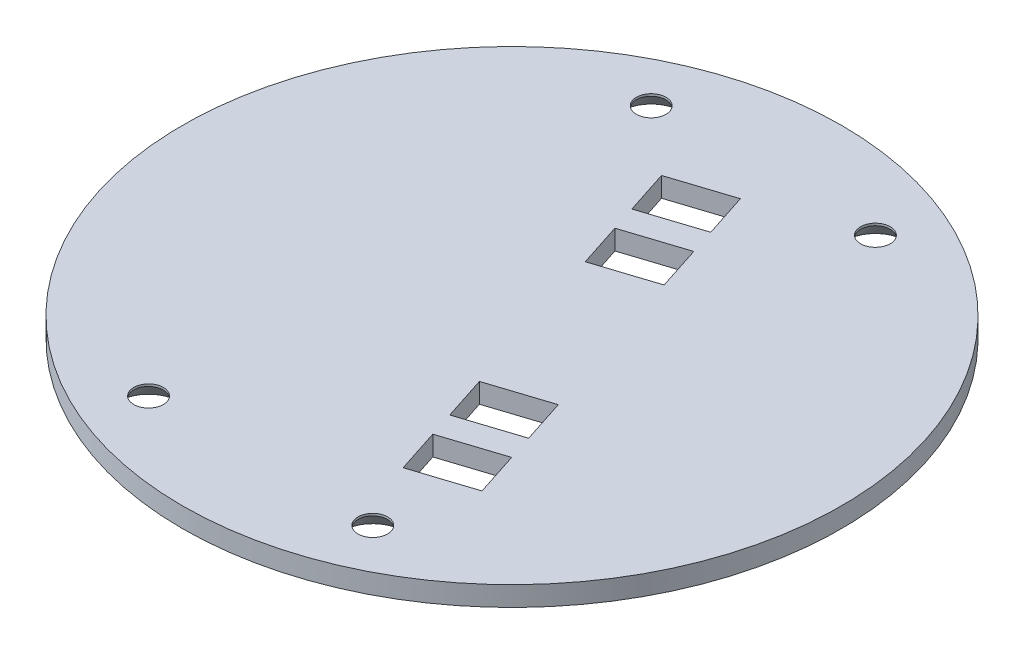
ISO-10303-21;
HEADER;
FILE_DESCRIPTION(('STEP AP214'),'2;1');
FILE_NAME('part.step','',(''),(''),'','','');
FILE_SCHEMA(('AUTOMOTIVE_DESIGN { 1 0 10303 214 1 1 1 1 }'));
ENDSEC;
DATA;
#1=APPLICATION_CONTEXT('core data for automotive mechanical design processes');
#2=APPLICATION_PROTOCOL_DEFINITION('international standard','automotive_design',2000,#1);
#3=PRODUCT_CONTEXT('',#1,'mechanical');
#4=PRODUCT('Part','Part','',(#3));
#5=PRODUCT_RELATED_PRODUCT_CATEGORY('part','',(#4));
#6=PRODUCT_DEFINITION_FORMATION('','',#4);
#7=PRODUCT_DEFINITION_CONTEXT('part definition',#1,'design');
#8=PRODUCT_DEFINITION('design','',#6,#7);
#9=PRODUCT_DEFINITION_SHAPE('','',#8);
#10=(LENGTH_UNIT() NAMED_UNIT(*) SI_UNIT(.MILLI.,.METRE.));
#11=(NAMED_UNIT(*) PLANE_ANGLE_UNIT() SI_UNIT($,.RADIAN.));
#12=(NAMED_UNIT(*) SI_UNIT($,.STERADIAN.) SOLID_ANGLE_UNIT());
#13=UNCERTAINTY_MEASURE_WITH_UNIT(LENGTH_MEASURE(1.E-05),#10,'distance_accuracy_value','');
#14=(GEOMETRIC_REPRESENTATION_CONTEXT(3) GLOBAL_UNCERTAINTY_ASSIGNED_CONTEXT((#13)) GLOBAL_UNIT_ASSIGNED_CONTEXT((#10,
#11,#12)) REPRESENTATION_CONTEXT('',''));
#15=CARTESIAN_POINT('',(0.,0.,0.));
#16=DIRECTION('',(0.,0.,1.));
#17=DIRECTION('',(1.,0.,0.));
#18=AXIS2_PLACEMENT_3D('',#15,#16,#17);
#19=CARTESIAN_POINT('',(0.,1.5,0.));
#20=DIRECTION('',(0.,1.,0.));
#21=DIRECTION('',(0.,0.,1.));
#22=AXIS2_PLACEMENT_3D('',#19,#20,#21);
#23=PLANE('',#22);
#24=CARTESIAN_POINT('',(17.0092592584861,1.5,38.1280421668568));
#25=DIRECTION('',(0.,-1.,0.));
#26=DIRECTION('',(0.,0.,-1.));
#27=AXIS2_PLACEMENT_3D('',#24,#25,#26);
#28=CIRCLE('',#27,2.2479);
#29=CARTESIAN_POINT('',(17.0092592584861,1.5,35.8801421668568));
#30=VERTEX_POINT('',#29);
#31=EDGE_CURVE('E366',#30,#30,#28,.T.);
#32=ORIENTED_EDGE('',*,*,#31,.T.);
#33=EDGE_LOOP('',(#32));
#34=FACE_BOUND('',#33,.T.);
#35=CARTESIAN_POINT('',(-17.0092592584861,1.5,38.1280421668568));
#36=DIRECTION('',(0.,-1.,0.));
#37=DIRECTION('',(0.,0.,-1.));
#38=AXIS2_PLACEMENT_3D('',#35,#36,#37);
#39=CIRCLE('',#38,2.2479);
#40=CARTESIAN_POINT('',(-17.0092592584861,1.5,35.8801421668568));
#41=VERTEX_POINT('',#40);
#42=EDGE_CURVE('E370',#41,#41,#39,.T.);
#43=ORIENTED_EDGE('',*,*,#42,.T.);
#44=EDGE_LOOP('',(#43));
#45=FACE_BOUND('',#44,.T.);
#46=CARTESIAN_POINT('',(-17.009259258486,1.5,-38.1280421668568));
#47=DIRECTION('',(0.,-1.,0.));
#48=DIRECTION('',(0.,0.,-1.));
#49=AXIS2_PLACEMENT_3D('',#46,#47,#48);
#50=CIRCLE('',#49,2.2479);
#51=CARTESIAN_POINT('',(-17.009259258486,1.5,-40.3759421668567));
#52=VERTEX_POINT('',#51);
#53=EDGE_CURVE('E374',#52,#52,#50,.T.);
#54=ORIENTED_EDGE('',*,*,#53,.T.);
#55=EDGE_LOOP('',(#54));
#56=FACE_BOUND('',#55,.T.);
#57=CARTESIAN_POINT('',(17.009259258486,1.5,-38.1280421668568));
#58=DIRECTION('',(0.,-1.,0.));
#59=DIRECTION('',(0.,0.,-1.));
#60=AXIS2_PLACEMENT_3D('',#57,#58,#59);
#61=CIRCLE('',#60,2.2479);
#62=CARTESIAN_POINT('',(17.009259258486,1.5,-40.3759421668567));
#63=VERTEX_POINT('',#62);
#64=EDGE_CURVE('E378',#63,#63,#61,.T.);
#65=ORIENTED_EDGE('',*,*,#64,.T.);
#66=EDGE_LOOP('',(#65));
#67=FACE_BOUND('',#66,.T.);
#68=DIRECTION('',(0.308303520094528,0.,0.951288042339082));
#69=VECTOR('',#68,1.);
#70=CARTESIAN_POINT('',(-7.06797710635094,1.5,-29.7553595949385));
#71=LINE('',#70,#69);
#72=CARTESIAN_POINT('',(-7.06797710635094,1.5,-29.7553595949385));
#73=VERTEX_POINT('',#72);
#74=CARTESIAN_POINT('',(-4.90985246568924,1.5,-23.0963432985649));
#75=VERTEX_POINT('',#74);
#76=EDGE_CURVE('E55',#73,#75,#71,.T.);
#77=ORIENTED_EDGE('',*,*,#76,.F.);
#78=DIRECTION('',(-0.951288042339082,0.,0.308303520094528));
#79=VECTOR('',#78,1.);
#80=CARTESIAN_POINT('',(1.96925929587035,1.5,-32.6842430358365));
#81=LINE('',#80,#79);
#82=CARTESIAN_POINT('',(1.96925929587035,1.5,-32.6842430358365));
#83=VERTEX_POINT('',#82);
#84=EDGE_CURVE('E172',#83,#73,#81,.T.);
#85=ORIENTED_EDGE('',*,*,#84,.F.);
#86=DIRECTION('',(-0.308303520094528,0.,-0.951288042339082));
#87=VECTOR('',#86,1.);
#88=CARTESIAN_POINT('',(4.12738393653204,1.5,-26.025226739463));
#89=LINE('',#88,#87);
#90=CARTESIAN_POINT('',(4.12738393653204,1.5,-26.025226739463));
#91=VERTEX_POINT('',#90);
#92=EDGE_CURVE('E178',#91,#83,#89,.T.);
#93=ORIENTED_EDGE('',*,*,#92,.F.);
#94=DIRECTION('',(0.951288042339082,0.,-0.308303520094528));
#95=VECTOR('',#94,1.);
#96=CARTESIAN_POINT('',(-4.90985246568924,1.5,-23.0963432985649));
#97=LINE('',#96,#95);
#98=EDGE_CURVE('E190',#75,#91,#97,.T.);
#99=ORIENTED_EDGE('',*,*,#98,.F.);
#100=EDGE_LOOP('',(#77,#85,#93,#99));
#101=FACE_BOUND('',#100,.T.);
#102=DIRECTION('',(-0.308303520094528,0.,-0.951288042339082));
#103=VECTOR('',#102,1.);
#104=CARTESIAN_POINT('',(5.36059801691015,1.5,-22.2200745701066));
#105=LINE('',#104,#103);
#106=CARTESIAN_POINT('',(7.51872265757185,1.5,-15.5610582737331));
#107=VERTEX_POINT('',#106);
#108=CARTESIAN_POINT('',(5.36059801691015,1.5,-22.2200745701066));
#109=VERTEX_POINT('',#108);
#110=EDGE_CURVE('E200',#107,#109,#105,.T.);
#111=ORIENTED_EDGE('',*,*,#110,.F.);
#112=DIRECTION('',(0.951288042339082,0.,-0.308303520094528));
#113=VECTOR('',#112,1.);
#114=CARTESIAN_POINT('',(7.51872265757185,1.5,-15.5610582737331));
#115=LINE('',#114,#113);
#116=CARTESIAN_POINT('',(-1.51851374464943,1.5,-12.632174832835));
#117=VERTEX_POINT('',#116);
#118=EDGE_CURVE('E211',#117,#107,#115,.T.);
#119=ORIENTED_EDGE('',*,*,#118,.F.);
#120=DIRECTION('',(0.308303520094528,0.,0.951288042339082));
#121=VECTOR('',#120,1.);
#122=CARTESIAN_POINT('',(-1.51851374464943,1.5,-12.632174832835));
#123=LINE('',#122,#121);
#124=CARTESIAN_POINT('',(-3.67663838531113,1.5,-19.2911911292086));
#125=VERTEX_POINT('',#124);
#126=EDGE_CURVE('E230',#125,#117,#123,.T.);
#127=ORIENTED_EDGE('',*,*,#126,.F.);
#128=DIRECTION('',(-0.951288042339082,0.,0.308303520094528));
#129=VECTOR('',#128,1.);
#130=CARTESIAN_POINT('',(-3.67663838531113,1.5,-19.2911911292086));
#131=LINE('',#130,#129);
#132=EDGE_CURVE('E226',#109,#125,#131,.T.);
#133=ORIENTED_EDGE('',*,*,#132,.F.);
#134=EDGE_LOOP('',(#111,#119,#127,#133));
#135=FACE_BOUND('',#134,.T.);
#136=DIRECTION('',(0.308303520094527,0.,0.951288042339082));
#137=VECTOR('',#136,1.);
#138=CARTESIAN_POINT('',(11.7292885138124,1.5,28.2446723464753));
#139=LINE('',#138,#137);
#140=CARTESIAN_POINT('',(9.57116387315074,1.5,21.5856560501018));
#141=VERTEX_POINT('',#140);
#142=CARTESIAN_POINT('',(11.7292885138124,1.5,28.2446723464753));
#143=VERTEX_POINT('',#142);
#144=EDGE_CURVE('E240',#141,#143,#139,.T.);
#145=ORIENTED_EDGE('',*,*,#144,.F.);
#146=DIRECTION('',(-0.951288042339082,0.,0.308303520094527));
#147=VECTOR('',#146,1.);
#148=CARTESIAN_POINT('',(9.57116387315074,1.5,21.5856560501018));
#149=LINE('',#148,#147);
#150=CARTESIAN_POINT('',(18.608400275372,1.5,18.6567726092037));
#151=VERTEX_POINT('',#150);
#152=EDGE_CURVE('E255',#151,#141,#149,.T.);
#153=ORIENTED_EDGE('',*,*,#152,.F.);
#154=DIRECTION('',(-0.308303520094528,0.,-0.951288042339082));
#155=VECTOR('',#154,1.);
#156=CARTESIAN_POINT('',(18.608400275372,1.5,18.6567726092037));
#157=LINE('',#156,#155);
#158=CARTESIAN_POINT('',(20.7665249160337,1.5,25.3157889055773));
#159=VERTEX_POINT('',#158);
#160=EDGE_CURVE('E274',#159,#151,#157,.T.);
#161=ORIENTED_EDGE('',*,*,#160,.F.);
#162=DIRECTION('',(0.951288042339082,0.,-0.308303520094527));
#163=VECTOR('',#162,1.);
#164=CARTESIAN_POINT('',(20.7665249160337,1.5,25.3157889055773));
#165=LINE('',#164,#163);
#166=EDGE_CURVE('E270',#143,#159,#165,.T.);
#167=ORIENTED_EDGE('',*,*,#166,.F.);
#168=EDGE_LOOP('',(#145,#153,#161,#167));
#169=FACE_BOUND('',#168,.T.);
#170=DIRECTION('',(0.308303520094528,0.,0.951288042339082));
#171=VECTOR('',#170,1.);
#172=CARTESIAN_POINT('',(6.17982515211094,1.5,11.1214875843719));
#173=LINE('',#172,#171);
#174=CARTESIAN_POINT('',(6.17982515211094,1.5,11.1214875843719));
#175=VERTEX_POINT('',#174);
#176=CARTESIAN_POINT('',(8.33794979277263,1.5,17.7805038807454));
#177=VERTEX_POINT('',#176);
#178=EDGE_CURVE('E284',#175,#177,#173,.T.);
#179=ORIENTED_EDGE('',*,*,#178,.F.);
#180=DIRECTION('',(-0.951288042339082,0.,0.308303520094528));
#181=VECTOR('',#180,1.);
#182=CARTESIAN_POINT('',(15.2170615543322,1.5,8.19260414347383));
#183=LINE('',#182,#181);
#184=CARTESIAN_POINT('',(15.2170615543322,1.5,8.19260414347383));
#185=VERTEX_POINT('',#184);
#186=EDGE_CURVE('E299',#185,#175,#183,.T.);
#187=ORIENTED_EDGE('',*,*,#186,.F.);
#188=DIRECTION('',(-0.308303520094528,0.,-0.951288042339082));
#189=VECTOR('',#188,1.);
#190=CARTESIAN_POINT('',(17.3751861949939,1.5,14.8516204398474));
#191=LINE('',#190,#189);
#192=CARTESIAN_POINT('',(17.3751861949939,1.5,14.8516204398474));
#193=VERTEX_POINT('',#192);
#194=EDGE_CURVE('E317',#193,#185,#191,.T.);
#195=ORIENTED_EDGE('',*,*,#194,.F.);
#196=DIRECTION('',(0.951288042339082,0.,-0.308303520094528));
#197=VECTOR('',#196,1.);
#198=CARTESIAN_POINT('',(8.33794979277263,1.5,17.7805038807454));
#199=LINE('',#198,#197);
#200=EDGE_CURVE('E313',#177,#193,#199,.T.);
#201=ORIENTED_EDGE('',*,*,#200,.F.);
#202=EDGE_LOOP('',(#179,#187,#195,#201));
#203=FACE_BOUND('',#202,.T.);
#204=CARTESIAN_POINT('',(0.,1.5,0.));
#205=DIRECTION('',(0.,1.,0.));
#206=DIRECTION('',(0.,0.,1.));
#207=AXIS2_PLACEMENT_3D('',#204,#205,#206);
#208=CIRCLE('',#207,50.);
#209=CARTESIAN_POINT('',(0.,1.5,50.));
#210=VERTEX_POINT('',#209);
#211=EDGE_CURVE('E181',#210,#210,#208,.T.);
#212=ORIENTED_EDGE('',*,*,#211,.T.);
#213=EDGE_LOOP('',(#212));
#214=FACE_BOUND('',#213,.T.);
#215=ADVANCED_FACE('F37',(#34,#45,#56,#67,#101,#135,#169,#203,#214),#23,.T.);
#216=CARTESIAN_POINT('',(0.,-1.5,0.));
#217=DIRECTION('',(0.,1.,0.));
#218=DIRECTION('',(0.,0.,1.));
#219=AXIS2_PLACEMENT_3D('',#216,#217,#218);
#220=PLANE('',#219);
#221=CARTESIAN_POINT('',(17.0092592584861,-1.5,38.1280421668568));
#222=DIRECTION('',(0.,-1.,0.));
#223=DIRECTION('',(0.,0.,-1.));
#224=AXIS2_PLACEMENT_3D('',#221,#222,#223);
#225=CIRCLE('',#224,4.5593);
#226=CARTESIAN_POINT('',(17.0092592584861,-1.5,33.5687421668568));
#227=VERTEX_POINT('',#226);
#228=EDGE_CURVE('E697',#227,#227,#225,.T.);
#229=ORIENTED_EDGE('',*,*,#228,.F.);
#230=EDGE_LOOP('',(#229));
#231=FACE_BOUND('',#230,.T.);
#232=CARTESIAN_POINT('',(-17.0092592584861,-1.5,38.1280421668568));
#233=DIRECTION('',(0.,-1.,0.));
#234=DIRECTION('',(0.,0.,-1.));
#235=AXIS2_PLACEMENT_3D('',#232,#233,#234);
#236=CIRCLE('',#235,4.5593);
#237=CARTESIAN_POINT('',(-17.0092592584861,-1.5,33.5687421668568));
#238=VERTEX_POINT('',#237);
#239=EDGE_CURVE('E705',#238,#238,#236,.T.);
#240=ORIENTED_EDGE('',*,*,#239,.F.);
#241=EDGE_LOOP('',(#240));
#242=FACE_BOUND('',#241,.T.);
#243=CARTESIAN_POINT('',(-17.009259258486,-1.5,-38.1280421668568));
#244=DIRECTION('',(0.,-1.,0.));
#245=DIRECTION('',(0.,0.,-1.));
#246=AXIS2_PLACEMENT_3D('',#243,#244,#245);
#247=CIRCLE('',#246,4.5593);
#248=CARTESIAN_POINT('',(-17.009259258486,-1.5,-42.6873421668568));
#249=VERTEX_POINT('',#248);
#250=EDGE_CURVE('E714',#249,#249,#247,.T.);
#251=ORIENTED_EDGE('',*,*,#250,.F.);
#252=EDGE_LOOP('',(#251));
#253=FACE_BOUND('',#252,.T.);
#254=CARTESIAN_POINT('',(17.009259258486,-1.5,-38.1280421668568));
#255=DIRECTION('',(0.,-1.,0.));
#256=DIRECTION('',(0.,0.,-1.));
#257=AXIS2_PLACEMENT_3D('',#254,#255,#256);
#258=CIRCLE('',#257,4.5593);
#259=CARTESIAN_POINT('',(17.009259258486,-1.5,-42.6873421668568));
#260=VERTEX_POINT('',#259);
#261=EDGE_CURVE('E723',#260,#260,#258,.T.);
#262=ORIENTED_EDGE('',*,*,#261,.F.);
#263=EDGE_LOOP('',(#262));
#264=FACE_BOUND('',#263,.T.);
#265=DIRECTION('',(-0.951288042339082,0.,0.308303520094528));
#266=VECTOR('',#265,1.);
#267=CARTESIAN_POINT('',(1.96925929587035,-1.5,-32.6842430358365));
#268=LINE('',#267,#266);
#269=CARTESIAN_POINT('',(1.96925929587035,-1.5,-32.6842430358365));
#270=VERTEX_POINT('',#269);
#271=CARTESIAN_POINT('',(-7.06797710635094,-1.5,-29.7553595949385));
#272=VERTEX_POINT('',#271);
#273=EDGE_CURVE('E161',#270,#272,#268,.T.);
#274=ORIENTED_EDGE('',*,*,#273,.T.);
#275=DIRECTION('',(0.308303520094528,0.,0.951288042339082));
#276=VECTOR('',#275,1.);
#277=CARTESIAN_POINT('',(-7.06797710635094,-1.5,-29.7553595949385));
#278=LINE('',#277,#276);
#279=CARTESIAN_POINT('',(-4.90985246568924,-1.5,-23.0963432985649));
#280=VERTEX_POINT('',#279);
#281=EDGE_CURVE('E154',#272,#280,#278,.T.);
#282=ORIENTED_EDGE('',*,*,#281,.T.);
#283=DIRECTION('',(0.951288042339082,0.,-0.308303520094528));
#284=VECTOR('',#283,1.);
#285=CARTESIAN_POINT('',(-4.90985246568924,-1.5,-23.0963432985649));
#286=LINE('',#285,#284);
#287=CARTESIAN_POINT('',(4.12738393653204,-1.5,-26.025226739463));
#288=VERTEX_POINT('',#287);
#289=EDGE_CURVE('E164',#280,#288,#286,.T.);
#290=ORIENTED_EDGE('',*,*,#289,.T.);
#291=DIRECTION('',(-0.308303520094528,0.,-0.951288042339082));
#292=VECTOR('',#291,1.);
#293=CARTESIAN_POINT('',(4.12738393653204,-1.5,-26.025226739463));
#294=LINE('',#293,#292);
#295=EDGE_CURVE('E63',#288,#270,#294,.T.);
#296=ORIENTED_EDGE('',*,*,#295,.T.);
#297=EDGE_LOOP('',(#274,#282,#290,#296));
#298=FACE_BOUND('',#297,.T.);
#299=DIRECTION('',(0.951288042339082,0.,-0.308303520094528));
#300=VECTOR('',#299,1.);
#301=CARTESIAN_POINT('',(7.51872265757185,-1.5,-15.5610582737331));
#302=LINE('',#301,#300);
#303=CARTESIAN_POINT('',(-1.51851374464943,-1.5,-12.632174832835));
#304=VERTEX_POINT('',#303);
#305=CARTESIAN_POINT('',(7.51872265757185,-1.5,-15.5610582737331));
#306=VERTEX_POINT('',#305);
#307=EDGE_CURVE('E219',#304,#306,#302,.T.);
#308=ORIENTED_EDGE('',*,*,#307,.T.);
#309=DIRECTION('',(-0.308303520094528,0.,-0.951288042339082));
#310=VECTOR('',#309,1.);
#311=CARTESIAN_POINT('',(5.36059801691015,-1.5,-22.2200745701066));
#312=LINE('',#311,#310);
#313=CARTESIAN_POINT('',(5.36059801691015,-1.5,-22.2200745701066));
#314=VERTEX_POINT('',#313);
#315=EDGE_CURVE('E206',#306,#314,#312,.T.);
#316=ORIENTED_EDGE('',*,*,#315,.T.);
#317=DIRECTION('',(-0.951288042339082,0.,0.308303520094528));
#318=VECTOR('',#317,1.);
#319=CARTESIAN_POINT('',(-3.67663838531113,-1.5,-19.2911911292086));
#320=LINE('',#319,#318);
#321=CARTESIAN_POINT('',(-3.67663838531113,-1.5,-19.2911911292086));
#322=VERTEX_POINT('',#321);
#323=EDGE_CURVE('E210',#314,#322,#320,.T.);
#324=ORIENTED_EDGE('',*,*,#323,.T.);
#325=DIRECTION('',(0.308303520094528,0.,0.951288042339082));
#326=VECTOR('',#325,1.);
#327=CARTESIAN_POINT('',(-1.51851374464943,-1.5,-12.632174832835));
#328=LINE('',#327,#326);
#329=EDGE_CURVE('E215',#322,#304,#328,.T.);
#330=ORIENTED_EDGE('',*,*,#329,.T.);
#331=EDGE_LOOP('',(#308,#316,#324,#330));
#332=FACE_BOUND('',#331,.T.);
#333=DIRECTION('',(-0.951288042339082,0.,0.308303520094527));
#334=VECTOR('',#333,1.);
#335=CARTESIAN_POINT('',(9.57116387315074,-1.5,21.5856560501018));
#336=LINE('',#335,#334);
#337=CARTESIAN_POINT('',(18.608400275372,-1.5,18.6567726092037));
#338=VERTEX_POINT('',#337);
#339=CARTESIAN_POINT('',(9.57116387315074,-1.5,21.5856560501018));
#340=VERTEX_POINT('',#339);
#341=EDGE_CURVE('E263',#338,#340,#336,.T.);
#342=ORIENTED_EDGE('',*,*,#341,.T.);
#343=DIRECTION('',(0.308303520094527,0.,0.951288042339082));
#344=VECTOR('',#343,1.);
#345=CARTESIAN_POINT('',(11.7292885138124,-1.5,28.2446723464753));
#346=LINE('',#345,#344);
#347=CARTESIAN_POINT('',(11.7292885138124,-1.5,28.2446723464753));
#348=VERTEX_POINT('',#347);
#349=EDGE_CURVE('E250',#340,#348,#346,.T.);
#350=ORIENTED_EDGE('',*,*,#349,.T.);
#351=DIRECTION('',(0.951288042339082,0.,-0.308303520094527));
#352=VECTOR('',#351,1.);
#353=CARTESIAN_POINT('',(20.7665249160337,-1.5,25.3157889055773));
#354=LINE('',#353,#352);
#355=CARTESIAN_POINT('',(20.7665249160337,-1.5,25.3157889055773));
#356=VERTEX_POINT('',#355);
#357=EDGE_CURVE('E254',#348,#356,#354,.T.);
#358=ORIENTED_EDGE('',*,*,#357,.T.);
#359=DIRECTION('',(-0.308303520094528,0.,-0.951288042339082));
#360=VECTOR('',#359,1.);
#361=CARTESIAN_POINT('',(18.608400275372,-1.5,18.6567726092037));
#362=LINE('',#361,#360);
#363=EDGE_CURVE('E259',#356,#338,#362,.T.);
#364=ORIENTED_EDGE('',*,*,#363,.T.);
#365=EDGE_LOOP('',(#342,#350,#358,#364));
#366=FACE_BOUND('',#365,.T.);
#367=DIRECTION('',(-0.951288042339082,0.,0.308303520094528));
#368=VECTOR('',#367,1.);
#369=CARTESIAN_POINT('',(15.2170615543322,-1.5,8.19260414347383));
#370=LINE('',#369,#368);
#371=CARTESIAN_POINT('',(15.2170615543322,-1.5,8.19260414347383));
#372=VERTEX_POINT('',#371);
#373=CARTESIAN_POINT('',(6.17982515211094,-1.5,11.1214875843719));
#374=VERTEX_POINT('',#373);
#375=EDGE_CURVE('E307',#372,#374,#370,.T.);
#376=ORIENTED_EDGE('',*,*,#375,.T.);
#377=DIRECTION('',(0.308303520094528,0.,0.951288042339082));
#378=VECTOR('',#377,1.);
#379=CARTESIAN_POINT('',(6.17982515211094,-1.5,11.1214875843719));
#380=LINE('',#379,#378);
#381=CARTESIAN_POINT('',(8.33794979277263,-1.5,17.7805038807454));
#382=VERTEX_POINT('',#381);
#383=EDGE_CURVE('E294',#374,#382,#380,.T.);
#384=ORIENTED_EDGE('',*,*,#383,.T.);
#385=DIRECTION('',(0.951288042339082,0.,-0.308303520094528));
#386=VECTOR('',#385,1.);
#387=CARTESIAN_POINT('',(8.33794979277263,-1.5,17.7805038807454));
#388=LINE('',#387,#386);
#389=CARTESIAN_POINT('',(17.3751861949939,-1.5,14.8516204398474));
#390=VERTEX_POINT('',#389);
#391=EDGE_CURVE('E298',#382,#390,#388,.T.);
#392=ORIENTED_EDGE('',*,*,#391,.T.);
#393=DIRECTION('',(-0.308303520094528,0.,-0.951288042339082));
#394=VECTOR('',#393,1.);
#395=CARTESIAN_POINT('',(17.3751861949939,-1.5,14.8516204398474));
#396=LINE('',#395,#394);
#397=EDGE_CURVE('E303',#390,#372,#396,.T.);
#398=ORIENTED_EDGE('',*,*,#397,.T.);
#399=EDGE_LOOP('',(#376,#384,#392,#398));
#400=FACE_BOUND('',#399,.T.);
#401=CARTESIAN_POINT('',(0.,-1.5,0.));
#402=DIRECTION('',(0.,1.,0.));
#403=DIRECTION('',(0.,0.,1.));
#404=AXIS2_PLACEMENT_3D('',#401,#402,#403);
#405=CIRCLE('',#404,50.);
#406=CARTESIAN_POINT('',(0.,-1.5,50.));
#407=VERTEX_POINT('',#406);
#408=EDGE_CURVE('E191',#407,#407,#405,.F.);
#409=ORIENTED_EDGE('',*,*,#408,.T.);
#410=EDGE_LOOP('',(#409));
#411=FACE_BOUND('',#410,.T.);
#412=ADVANCED_FACE('F39',(#231,#242,#253,#264,#298,#332,#366,#400,#411),#220,.F.);
#413=CARTESIAN_POINT('',(6.17982515211094,-1.5,11.1214875843719));
#414=DIRECTION('',(-0.951288042339082,0.,0.308303520094528));
#415=DIRECTION('',(0.308303520094528,0.,0.951288042339082));
#416=AXIS2_PLACEMENT_3D('',#413,#414,#415);
#417=PLANE('',#416);
#418=ORIENTED_EDGE('',*,*,#178,.T.);
#419=DIRECTION('',(0.,1.,0.));
#420=VECTOR('',#419,1.);
#421=CARTESIAN_POINT('',(8.33794979277263,-1.5,17.7805038807454));
#422=LINE('',#421,#420);
#423=EDGE_CURVE('E41',#382,#177,#422,.T.);
#424=ORIENTED_EDGE('',*,*,#423,.F.);
#425=ORIENTED_EDGE('',*,*,#383,.F.);
#426=DIRECTION('',(0.,1.,0.));
#427=VECTOR('',#426,1.);
#428=CARTESIAN_POINT('',(6.17982515211094,-1.5,11.1214875843719));
#429=LINE('',#428,#427);
#430=EDGE_CURVE('E11',#374,#175,#429,.T.);
#431=ORIENTED_EDGE('',*,*,#430,.T.);
#432=EDGE_LOOP('',(#418,#424,#425,#431));
#433=FACE_BOUND('',#432,.T.);
#434=ADVANCED_FACE('F349',(#433),#417,.F.);
#435=CARTESIAN_POINT('',(15.2170615543322,-1.5,8.19260414347383));
#436=DIRECTION('',(-0.308303520094528,0.,-0.951288042339082));
#437=DIRECTION('',(-0.951288042339082,0.,0.308303520094528));
#438=AXIS2_PLACEMENT_3D('',#435,#436,#437);
#439=PLANE('',#438);
#440=ORIENTED_EDGE('',*,*,#186,.T.);
#441=ORIENTED_EDGE('',*,*,#430,.F.);
#442=ORIENTED_EDGE('',*,*,#375,.F.);
#443=DIRECTION('',(0.,1.,0.));
#444=VECTOR('',#443,1.);
#445=CARTESIAN_POINT('',(15.2170615543322,-1.5,8.19260414347383));
#446=LINE('',#445,#444);
#447=EDGE_CURVE('E47',#372,#185,#446,.T.);
#448=ORIENTED_EDGE('',*,*,#447,.T.);
#449=EDGE_LOOP('',(#440,#441,#442,#448));
#450=FACE_BOUND('',#449,.T.);
#451=ADVANCED_FACE('F346',(#450),#439,.F.);
#452=CARTESIAN_POINT('',(17.3751861949939,-1.5,14.8516204398474));
#453=DIRECTION('',(0.951288042339082,0.,-0.308303520094528));
#454=DIRECTION('',(-0.308303520094528,0.,-0.951288042339082));
#455=AXIS2_PLACEMENT_3D('',#452,#453,#454);
#456=PLANE('',#455);
#457=ORIENTED_EDGE('',*,*,#194,.T.);
#458=ORIENTED_EDGE('',*,*,#447,.F.);
#459=ORIENTED_EDGE('',*,*,#397,.F.);
#460=DIRECTION('',(0.,1.,0.));
#461=VECTOR('',#460,1.);
#462=CARTESIAN_POINT('',(17.3751861949939,-1.5,14.8516204398474));
#463=LINE('',#462,#461);
#464=EDGE_CURVE('E324',#390,#193,#463,.T.);
#465=ORIENTED_EDGE('',*,*,#464,.T.);
#466=EDGE_LOOP('',(#457,#458,#459,#465));
#467=FACE_BOUND('',#466,.T.);
#468=ADVANCED_FACE('F343',(#467),#456,.F.);
#469=CARTESIAN_POINT('',(8.33794979277263,-1.5,17.7805038807454));
#470=DIRECTION('',(0.308303520094528,0.,0.951288042339082));
#471=DIRECTION('',(0.951288042339082,0.,-0.308303520094528));
#472=AXIS2_PLACEMENT_3D('',#469,#470,#471);
#473=PLANE('',#472);
#474=ORIENTED_EDGE('',*,*,#200,.T.);
#475=ORIENTED_EDGE('',*,*,#464,.F.);
#476=ORIENTED_EDGE('',*,*,#391,.F.);
#477=ORIENTED_EDGE('',*,*,#423,.T.);
#478=EDGE_LOOP('',(#474,#475,#476,#477));
#479=FACE_BOUND('',#478,.T.);
#480=ADVANCED_FACE('F335',(#479),#473,.F.);
#481=CARTESIAN_POINT('',(11.7292885138124,-1.5,28.2446723464753));
#482=DIRECTION('',(-0.951288042339082,0.,0.308303520094527));
#483=DIRECTION('',(0.308303520094528,0.,0.951288042339082));
#484=AXIS2_PLACEMENT_3D('',#481,#482,#483);
#485=PLANE('',#484);
#486=ORIENTED_EDGE('',*,*,#144,.T.);
#487=DIRECTION('',(0.,1.,0.));
#488=VECTOR('',#487,1.);
#489=CARTESIAN_POINT('',(11.7292885138124,-1.5,28.2446723464753));
#490=LINE('',#489,#488);
#491=EDGE_CURVE('E267',#348,#143,#490,.T.);
#492=ORIENTED_EDGE('',*,*,#491,.F.);
#493=ORIENTED_EDGE('',*,*,#349,.F.);
#494=DIRECTION('',(0.,1.,0.));
#495=VECTOR('',#494,1.);
#496=CARTESIAN_POINT('',(9.57116387315074,-1.5,21.5856560501018));
#497=LINE('',#496,#495);
#498=EDGE_CURVE('E281',#340,#141,#497,.T.);
#499=ORIENTED_EDGE('',*,*,#498,.T.);
#500=EDGE_LOOP('',(#486,#492,#493,#499));
#501=FACE_BOUND('',#500,.T.);
#502=ADVANCED_FACE('F390',(#501),#485,.F.);
#503=CARTESIAN_POINT('',(9.57116387315074,-1.5,21.5856560501018));
#504=DIRECTION('',(-0.308303520094527,0.,-0.951288042339082));
#505=DIRECTION('',(-0.951288042339082,0.,0.308303520094527));
#506=AXIS2_PLACEMENT_3D('',#503,#504,#505);
#507=PLANE('',#506);
#508=ORIENTED_EDGE('',*,*,#152,.T.);
#509=ORIENTED_EDGE('',*,*,#498,.F.);
#510=ORIENTED_EDGE('',*,*,#341,.F.);
#511=DIRECTION('',(0.,1.,0.));
#512=VECTOR('',#511,1.);
#513=CARTESIAN_POINT('',(18.608400275372,-1.5,18.6567726092037));
#514=LINE('',#513,#512);
#515=EDGE_CURVE('E285',#338,#151,#514,.T.);
#516=ORIENTED_EDGE('',*,*,#515,.T.);
#517=EDGE_LOOP('',(#508,#509,#510,#516));
#518=FACE_BOUND('',#517,.T.);
#519=ADVANCED_FACE('F399',(#518),#507,.F.);
#520=CARTESIAN_POINT('',(18.608400275372,-1.5,18.6567726092037));
#521=DIRECTION('',(0.951288042339082,0.,-0.308303520094528));
#522=DIRECTION('',(-0.308303520094528,0.,-0.951288042339082));
#523=AXIS2_PLACEMENT_3D('',#520,#521,#522);
#524=PLANE('',#523);
#525=ORIENTED_EDGE('',*,*,#160,.T.);
#526=ORIENTED_EDGE('',*,*,#515,.F.);
#527=ORIENTED_EDGE('',*,*,#363,.F.);
#528=DIRECTION('',(0.,1.,0.));
#529=VECTOR('',#528,1.);
#530=CARTESIAN_POINT('',(20.7665249160337,-1.5,25.3157889055773));
#531=LINE('',#530,#529);
#532=EDGE_CURVE('E288',#356,#159,#531,.T.);
#533=ORIENTED_EDGE('',*,*,#532,.T.);
#534=EDGE_LOOP('',(#525,#526,#527,#533));
#535=FACE_BOUND('',#534,.T.);
#536=ADVANCED_FACE('F401',(#535),#524,.F.);
#537=CARTESIAN_POINT('',(20.7665249160337,-1.5,25.3157889055773));
#538=DIRECTION('',(0.308303520094527,0.,0.951288042339082));
#539=DIRECTION('',(0.951288042339082,0.,-0.308303520094527));
#540=AXIS2_PLACEMENT_3D('',#537,#538,#539);
#541=PLANE('',#540);
#542=ORIENTED_EDGE('',*,*,#166,.T.);
#543=ORIENTED_EDGE('',*,*,#532,.F.);
#544=ORIENTED_EDGE('',*,*,#357,.F.);
#545=ORIENTED_EDGE('',*,*,#491,.T.);
#546=EDGE_LOOP('',(#542,#543,#544,#545));
#547=FACE_BOUND('',#546,.T.);
#548=ADVANCED_FACE('F394',(#547),#541,.F.);
#549=CARTESIAN_POINT('',(5.36059801691015,-1.5,-22.2200745701066));
#550=DIRECTION('',(0.951288042339082,0.,-0.308303520094528));
#551=DIRECTION('',(-0.308303520094528,0.,-0.951288042339082));
#552=AXIS2_PLACEMENT_3D('',#549,#550,#551);
#553=PLANE('',#552);
#554=ORIENTED_EDGE('',*,*,#110,.T.);
#555=DIRECTION('',(0.,1.,0.));
#556=VECTOR('',#555,1.);
#557=CARTESIAN_POINT('',(5.36059801691015,-1.5,-22.2200745701066));
#558=LINE('',#557,#556);
#559=EDGE_CURVE('E223',#314,#109,#558,.T.);
#560=ORIENTED_EDGE('',*,*,#559,.F.);
#561=ORIENTED_EDGE('',*,*,#315,.F.);
#562=DIRECTION('',(0.,1.,0.));
#563=VECTOR('',#562,1.);
#564=CARTESIAN_POINT('',(7.51872265757185,-1.5,-15.5610582737331));
#565=LINE('',#564,#563);
#566=EDGE_CURVE('E237',#306,#107,#565,.T.);
#567=ORIENTED_EDGE('',*,*,#566,.T.);
#568=EDGE_LOOP('',(#554,#560,#561,#567));
#569=FACE_BOUND('',#568,.T.);
#570=ADVANCED_FACE('F408',(#569),#553,.F.);
#571=CARTESIAN_POINT('',(7.51872265757185,-1.5,-15.5610582737331));
#572=DIRECTION('',(0.308303520094528,0.,0.951288042339082));
#573=DIRECTION('',(0.951288042339082,0.,-0.308303520094528));
#574=AXIS2_PLACEMENT_3D('',#571,#572,#573);
#575=PLANE('',#574);
#576=ORIENTED_EDGE('',*,*,#118,.T.);
#577=ORIENTED_EDGE('',*,*,#566,.F.);
#578=ORIENTED_EDGE('',*,*,#307,.F.);
#579=DIRECTION('',(0.,1.,0.));
#580=VECTOR('',#579,1.);
#581=CARTESIAN_POINT('',(-1.51851374464943,-1.5,-12.632174832835));
#582=LINE('',#581,#580);
#583=EDGE_CURVE('E241',#304,#117,#582,.T.);
#584=ORIENTED_EDGE('',*,*,#583,.T.);
#585=EDGE_LOOP('',(#576,#577,#578,#584));
#586=FACE_BOUND('',#585,.T.);
#587=ADVANCED_FACE('F442',(#586),#575,.F.);
#588=CARTESIAN_POINT('',(-1.51851374464943,-1.5,-12.632174832835));
#589=DIRECTION('',(-0.951288042339082,0.,0.308303520094528));
#590=DIRECTION('',(0.308303520094528,0.,0.951288042339082));
#591=AXIS2_PLACEMENT_3D('',#588,#589,#590);
#592=PLANE('',#591);
#593=ORIENTED_EDGE('',*,*,#126,.T.);
#594=ORIENTED_EDGE('',*,*,#583,.F.);
#595=ORIENTED_EDGE('',*,*,#329,.F.);
#596=DIRECTION('',(0.,1.,0.));
#597=VECTOR('',#596,1.);
#598=CARTESIAN_POINT('',(-3.67663838531113,-1.5,-19.2911911292086));
#599=LINE('',#598,#597);
#600=EDGE_CURVE('E244',#322,#125,#599,.T.);
#601=ORIENTED_EDGE('',*,*,#600,.T.);
#602=EDGE_LOOP('',(#593,#594,#595,#601));
#603=FACE_BOUND('',#602,.T.);
#604=ADVANCED_FACE('F450',(#603),#592,.F.);
#605=CARTESIAN_POINT('',(-3.67663838531113,-1.5,-19.2911911292086));
#606=DIRECTION('',(-0.308303520094528,0.,-0.951288042339082));
#607=DIRECTION('',(-0.951288042339082,0.,0.308303520094528));
#608=AXIS2_PLACEMENT_3D('',#605,#606,#607);
#609=PLANE('',#608);
#610=ORIENTED_EDGE('',*,*,#132,.T.);
#611=ORIENTED_EDGE('',*,*,#600,.F.);
#612=ORIENTED_EDGE('',*,*,#323,.F.);
#613=ORIENTED_EDGE('',*,*,#559,.T.);
#614=EDGE_LOOP('',(#610,#611,#612,#613));
#615=FACE_BOUND('',#614,.T.);
#616=ADVANCED_FACE('F459',(#615),#609,.F.);
#617=CARTESIAN_POINT('',(-7.06797710635094,-1.5,-29.7553595949385));
#618=DIRECTION('',(-0.951288042339082,0.,0.308303520094528));
#619=DIRECTION('',(0.308303520094528,0.,0.951288042339082));
#620=AXIS2_PLACEMENT_3D('',#617,#618,#619);
#621=PLANE('',#620);
#622=ORIENTED_EDGE('',*,*,#76,.T.);
#623=DIRECTION('',(0.,1.,0.));
#624=VECTOR('',#623,1.);
#625=CARTESIAN_POINT('',(-4.90985246568924,-1.5,-23.0963432985649));
#626=LINE('',#625,#624);
#627=EDGE_CURVE('E150',#280,#75,#626,.T.);
#628=ORIENTED_EDGE('',*,*,#627,.F.);
#629=ORIENTED_EDGE('',*,*,#281,.F.);
#630=DIRECTION('',(0.,1.,0.));
#631=VECTOR('',#630,1.);
#632=CARTESIAN_POINT('',(-7.06797710635094,-1.5,-29.7553595949385));
#633=LINE('',#632,#631);
#634=EDGE_CURVE('E197',#272,#73,#633,.T.);
#635=ORIENTED_EDGE('',*,*,#634,.T.);
#636=EDGE_LOOP('',(#622,#628,#629,#635));
#637=FACE_BOUND('',#636,.T.);
#638=ADVANCED_FACE('F152',(#637),#621,.F.);
#639=CARTESIAN_POINT('',(1.96925929587035,-1.5,-32.6842430358365));
#640=DIRECTION('',(-0.308303520094528,0.,-0.951288042339082));
#641=DIRECTION('',(-0.951288042339082,0.,0.308303520094528));
#642=AXIS2_PLACEMENT_3D('',#639,#640,#641);
#643=PLANE('',#642);
#644=ORIENTED_EDGE('',*,*,#84,.T.);
#645=ORIENTED_EDGE('',*,*,#634,.F.);
#646=ORIENTED_EDGE('',*,*,#273,.F.);
#647=DIRECTION('',(0.,1.,0.));
#648=VECTOR('',#647,1.);
#649=CARTESIAN_POINT('',(1.96925929587035,-1.5,-32.6842430358365));
#650=LINE('',#649,#648);
#651=EDGE_CURVE('E201',#270,#83,#650,.T.);
#652=ORIENTED_EDGE('',*,*,#651,.T.);
#653=EDGE_LOOP('',(#644,#645,#646,#652));
#654=FACE_BOUND('',#653,.T.);
#655=ADVANCED_FACE('F476',(#654),#643,.F.);
#656=CARTESIAN_POINT('',(4.12738393653204,-1.5,-26.025226739463));
#657=DIRECTION('',(0.951288042339082,0.,-0.308303520094528));
#658=DIRECTION('',(-0.308303520094528,0.,-0.951288042339082));
#659=AXIS2_PLACEMENT_3D('',#656,#657,#658);
#660=PLANE('',#659);
#661=ORIENTED_EDGE('',*,*,#92,.T.);
#662=ORIENTED_EDGE('',*,*,#651,.F.);
#663=ORIENTED_EDGE('',*,*,#295,.F.);
#664=DIRECTION('',(0.,1.,0.));
#665=VECTOR('',#664,1.);
#666=CARTESIAN_POINT('',(4.12738393653204,-1.5,-26.025226739463));
#667=LINE('',#666,#665);
#668=EDGE_CURVE('E160',#288,#91,#667,.T.);
#669=ORIENTED_EDGE('',*,*,#668,.T.);
#670=EDGE_LOOP('',(#661,#662,#663,#669));
#671=FACE_BOUND('',#670,.T.);
#672=ADVANCED_FACE('F484',(#671),#660,.F.);
#673=CARTESIAN_POINT('',(-4.90985246568924,-1.5,-23.0963432985649));
#674=DIRECTION('',(0.308303520094529,0.,0.951288042339082));
#675=DIRECTION('',(0.951288042339082,0.,-0.308303520094529));
#676=AXIS2_PLACEMENT_3D('',#673,#674,#675);
#677=PLANE('',#676);
#678=ORIENTED_EDGE('',*,*,#98,.T.);
#679=ORIENTED_EDGE('',*,*,#668,.F.);
#680=ORIENTED_EDGE('',*,*,#289,.F.);
#681=ORIENTED_EDGE('',*,*,#627,.T.);
#682=EDGE_LOOP('',(#678,#679,#680,#681));
#683=FACE_BOUND('',#682,.T.);
#684=ADVANCED_FACE('F165',(#683),#677,.F.);
#685=CARTESIAN_POINT('',(0.,-142.92135623731,0.));
#686=DIRECTION('',(0.,1.,0.));
#687=DIRECTION('',(0.,0.,1.));
#688=AXIS2_PLACEMENT_3D('',#685,#686,#687);
#689=CYLINDRICAL_SURFACE('',#688,50.);
#690=ORIENTED_EDGE('',*,*,#408,.F.);
#691=EDGE_LOOP('',(#690));
#692=FACE_BOUND('',#691,.T.);
#693=ORIENTED_EDGE('',*,*,#211,.F.);
#694=EDGE_LOOP('',(#693));
#695=FACE_BOUND('',#694,.T.);
#696=ADVANCED_FACE('F500',(#692,#695),#689,.T.);
#697=CARTESIAN_POINT('',(17.009259258486,-1.5,-38.1280421668568));
#698=DIRECTION('',(0.,-1.,0.));
#699=DIRECTION('',(0.,0.,-1.));
#700=AXIS2_PLACEMENT_3D('',#697,#698,#699);
#701=CYLINDRICAL_SURFACE('',#700,2.24789999999999);
#702=ORIENTED_EDGE('',*,*,#64,.F.);
#703=EDGE_LOOP('',(#702));
#704=FACE_BOUND('',#703,.T.);
#705=CARTESIAN_POINT('',(17.009259258486,1.15896153645065,-38.1280421668568));
#706=DIRECTION('',(0.,-1.,0.));
#707=DIRECTION('',(0.,0.,-1.));
#708=AXIS2_PLACEMENT_3D('',#705,#706,#707);
#709=CIRCLE('',#708,2.24789999999999);
#710=CARTESIAN_POINT('',(17.009259258486,1.15896153645065,-40.3759421668567));
#711=VERTEX_POINT('',#710);
#712=EDGE_CURVE('E726',#711,#711,#709,.T.);
#713=ORIENTED_EDGE('',*,*,#712,.T.);
#714=EDGE_LOOP('',(#713));
#715=FACE_BOUND('',#714,.T.);
#716=ADVANCED_FACE('F508',(#704,#715),#701,.F.);
#717=CARTESIAN_POINT('',(17.009259258486,-1.5,-38.1280421668568));
#718=DIRECTION('',(0.,-1.,0.));
#719=DIRECTION('',(0.,0.,-1.));
#720=AXIS2_PLACEMENT_3D('',#717,#718,#719);
#721=CONICAL_SURFACE('',#720,4.5593,0.715584993317676);
#722=ORIENTED_EDGE('',*,*,#712,.F.);
#723=EDGE_LOOP('',(#722));
#724=FACE_BOUND('',#723,.T.);
#725=ORIENTED_EDGE('',*,*,#261,.T.);
#726=EDGE_LOOP('',(#725));
#727=FACE_BOUND('',#726,.T.);
#728=ADVANCED_FACE('F518',(#724,#727),#721,.F.);
#729=CARTESIAN_POINT('',(-17.009259258486,-1.5,-38.1280421668568));
#730=DIRECTION('',(0.,-1.,0.));
#731=DIRECTION('',(0.,0.,-1.));
#732=AXIS2_PLACEMENT_3D('',#729,#730,#731);
#733=CYLINDRICAL_SURFACE('',#732,2.24789999999999);
#734=ORIENTED_EDGE('',*,*,#53,.F.);
#735=EDGE_LOOP('',(#734));
#736=FACE_BOUND('',#735,.T.);
#737=CARTESIAN_POINT('',(-17.009259258486,1.15896153645065,-38.1280421668568));
#738=DIRECTION('',(0.,-1.,0.));
#739=DIRECTION('',(0.,0.,-1.));
#740=AXIS2_PLACEMENT_3D('',#737,#738,#739);
#741=CIRCLE('',#740,2.24789999999999);
#742=CARTESIAN_POINT('',(-17.009259258486,1.15896153645065,-40.3759421668567));
#743=VERTEX_POINT('',#742);
#744=EDGE_CURVE('E718',#743,#743,#741,.T.);
#745=ORIENTED_EDGE('',*,*,#744,.T.);
#746=EDGE_LOOP('',(#745));
#747=FACE_BOUND('',#746,.T.);
#748=ADVANCED_FACE('F528',(#736,#747),#733,.F.);
#749=CARTESIAN_POINT('',(-17.009259258486,-1.5,-38.1280421668568));
#750=DIRECTION('',(0.,-1.,0.));
#751=DIRECTION('',(0.,0.,-1.));
#752=AXIS2_PLACEMENT_3D('',#749,#750,#751);
#753=CONICAL_SURFACE('',#752,4.5593,0.715584993317676);
#754=ORIENTED_EDGE('',*,*,#744,.F.);
#755=EDGE_LOOP('',(#754));
#756=FACE_BOUND('',#755,.T.);
#757=ORIENTED_EDGE('',*,*,#250,.T.);
#758=EDGE_LOOP('',(#757));
#759=FACE_BOUND('',#758,.T.);
#760=ADVANCED_FACE('F537',(#756,#759),#753,.F.);
#761=CARTESIAN_POINT('',(-17.0092592584861,-1.5,38.1280421668568));
#762=DIRECTION('',(0.,-1.,0.));
#763=DIRECTION('',(0.,0.,-1.));
#764=AXIS2_PLACEMENT_3D('',#761,#762,#763);
#765=CYLINDRICAL_SURFACE('',#764,2.24789999999999);
#766=ORIENTED_EDGE('',*,*,#42,.F.);
#767=EDGE_LOOP('',(#766));
#768=FACE_BOUND('',#767,.T.);
#769=CARTESIAN_POINT('',(-17.0092592584861,1.15896153645065,38.1280421668568));
#770=DIRECTION('',(0.,-1.,0.));
#771=DIRECTION('',(0.,0.,-1.));
#772=AXIS2_PLACEMENT_3D('',#769,#770,#771);
#773=CIRCLE('',#772,2.24789999999999);
#774=CARTESIAN_POINT('',(-17.0092592584861,1.15896153645065,35.8801421668568));
#775=VERTEX_POINT('',#774);
#776=EDGE_CURVE('E708',#775,#775,#773,.T.);
#777=ORIENTED_EDGE('',*,*,#776,.T.);
#778=EDGE_LOOP('',(#777));
#779=FACE_BOUND('',#778,.T.);
#780=ADVANCED_FACE('F546',(#768,#779),#765,.F.);
#781=CARTESIAN_POINT('',(-17.0092592584861,-1.5,38.1280421668568));
#782=DIRECTION('',(0.,-1.,0.));
#783=DIRECTION('',(0.,0.,-1.));
#784=AXIS2_PLACEMENT_3D('',#781,#782,#783);
#785=CONICAL_SURFACE('',#784,4.5593,0.715584993317676);
#786=ORIENTED_EDGE('',*,*,#776,.F.);
#787=EDGE_LOOP('',(#786));
#788=FACE_BOUND('',#787,.T.);
#789=ORIENTED_EDGE('',*,*,#239,.T.);
#790=EDGE_LOOP('',(#789));
#791=FACE_BOUND('',#790,.T.);
#792=ADVANCED_FACE('F555',(#788,#791),#785,.F.);
#793=CARTESIAN_POINT('',(17.0092592584861,-1.5,38.1280421668568));
#794=DIRECTION('',(0.,-1.,0.));
#795=DIRECTION('',(0.,0.,-1.));
#796=AXIS2_PLACEMENT_3D('',#793,#794,#795);
#797=CYLINDRICAL_SURFACE('',#796,2.24789999999999);
#798=ORIENTED_EDGE('',*,*,#31,.F.);
#799=EDGE_LOOP('',(#798));
#800=FACE_BOUND('',#799,.T.);
#801=CARTESIAN_POINT('',(17.0092592584861,1.15896153645065,38.1280421668568));
#802=DIRECTION('',(0.,-1.,0.));
#803=DIRECTION('',(0.,0.,-1.));
#804=AXIS2_PLACEMENT_3D('',#801,#802,#803);
#805=CIRCLE('',#804,2.24789999999999);
#806=CARTESIAN_POINT('',(17.0092592584861,1.15896153645065,35.8801421668568));
#807=VERTEX_POINT('',#806);
#808=EDGE_CURVE('E694',#807,#807,#805,.T.);
#809=ORIENTED_EDGE('',*,*,#808,.T.);
#810=EDGE_LOOP('',(#809));
#811=FACE_BOUND('',#810,.T.);
#812=ADVANCED_FACE('F564',(#800,#811),#797,.F.);
#813=CARTESIAN_POINT('',(17.0092592584861,-1.5,38.1280421668568));
#814=DIRECTION('',(0.,-1.,0.));
#815=DIRECTION('',(0.,0.,-1.));
#816=AXIS2_PLACEMENT_3D('',#813,#814,#815);
#817=CONICAL_SURFACE('',#816,4.5593,0.715584993317676);
#818=ORIENTED_EDGE('',*,*,#808,.F.);
#819=EDGE_LOOP('',(#818));
#820=FACE_BOUND('',#819,.T.);
#821=ORIENTED_EDGE('',*,*,#228,.T.);
#822=EDGE_LOOP('',(#821));
#823=FACE_BOUND('',#822,.T.);
#824=ADVANCED_FACE('F573',(#820,#823),#817,.F.);
#825=CLOSED_SHELL('',(#215,#412,#434,#451,#468,#480,#502,#519,#536,#548,#570,#587,#604,#616,
#638,#655,#672,#684,#696,#716,#728,#748,#760,#780,#792,#812,#824));
#826=MANIFOLD_SOLID_BREP('B2',#825);
#827=ADVANCED_BREP_SHAPE_REPRESENTATION('',(#18,#826),#14);
#828=SHAPE_DEFINITION_REPRESENTATION(#9,#827);
ENDSEC;
END-ISO-10303-21;
